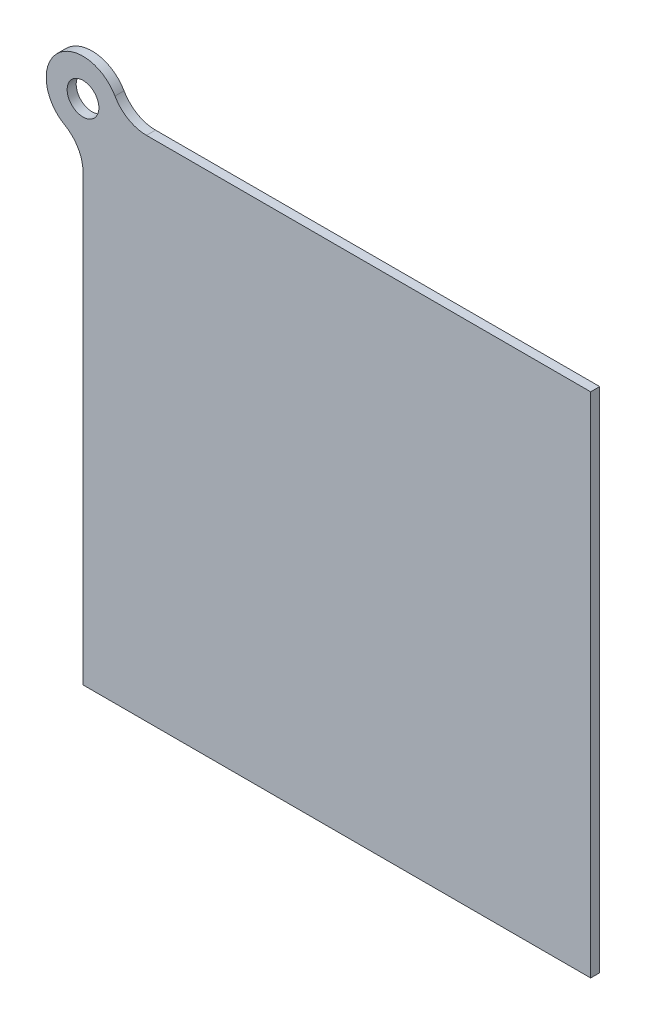
ISO-10303-21;
HEADER;
FILE_DESCRIPTION(('STEP AP214'),'2;1');
FILE_NAME('part.step','',(''),(''),'','','');
FILE_SCHEMA(('AUTOMOTIVE_DESIGN { 1 0 10303 214 1 1 1 1 }'));
ENDSEC;
DATA;
#1=APPLICATION_CONTEXT('core data for automotive mechanical design processes');
#2=APPLICATION_PROTOCOL_DEFINITION('international standard','automotive_design',2000,#1);
#3=PRODUCT_CONTEXT('',#1,'mechanical');
#4=PRODUCT('Part','Part','',(#3));
#5=PRODUCT_RELATED_PRODUCT_CATEGORY('part','',(#4));
#6=PRODUCT_DEFINITION_FORMATION('','',#4);
#7=PRODUCT_DEFINITION_CONTEXT('part definition',#1,'design');
#8=PRODUCT_DEFINITION('design','',#6,#7);
#9=PRODUCT_DEFINITION_SHAPE('','',#8);
#10=(LENGTH_UNIT() NAMED_UNIT(*) SI_UNIT(.MILLI.,.METRE.));
#11=(NAMED_UNIT(*) PLANE_ANGLE_UNIT() SI_UNIT($,.RADIAN.));
#12=(NAMED_UNIT(*) SI_UNIT($,.STERADIAN.) SOLID_ANGLE_UNIT());
#13=UNCERTAINTY_MEASURE_WITH_UNIT(LENGTH_MEASURE(1.E-05),#10,'distance_accuracy_value','');
#14=(GEOMETRIC_REPRESENTATION_CONTEXT(3) GLOBAL_UNCERTAINTY_ASSIGNED_CONTEXT((#13)) GLOBAL_UNIT_ASSIGNED_CONTEXT((#10,
#11,#12)) REPRESENTATION_CONTEXT('',''));
#15=CARTESIAN_POINT('',(0.,0.,0.));
#16=DIRECTION('',(0.,0.,1.));
#17=DIRECTION('',(1.,0.,0.));
#18=AXIS2_PLACEMENT_3D('',#15,#16,#17);
#19=CARTESIAN_POINT('',(0.,0.,2.54));
#20=DIRECTION('',(0.,0.,1.));
#21=DIRECTION('',(1.,0.,0.));
#22=AXIS2_PLACEMENT_3D('',#19,#20,#21);
#23=PLANE('',#22);
#24=DIRECTION('',(1.,0.,0.));
#25=VECTOR('',#24,1.);
#26=CARTESIAN_POINT('',(0.,-142.24,2.54));
#27=LINE('',#26,#25);
#28=CARTESIAN_POINT('',(0.,-142.24,2.54));
#29=VERTEX_POINT('',#28);
#30=CARTESIAN_POINT('',(142.24,-142.24,2.54));
#31=VERTEX_POINT('',#30);
#32=EDGE_CURVE('E102',#29,#31,#27,.T.);
#33=ORIENTED_EDGE('',*,*,#32,.T.);
#34=DIRECTION('',(0.,1.,0.));
#35=VECTOR('',#34,1.);
#36=CARTESIAN_POINT('',(142.24,-142.24,2.54));
#37=LINE('',#36,#35);
#38=CARTESIAN_POINT('',(142.24,0.,2.54));
#39=VERTEX_POINT('',#38);
#40=EDGE_CURVE('E92',#31,#39,#37,.T.);
#41=ORIENTED_EDGE('',*,*,#40,.T.);
#42=DIRECTION('',(-1.,0.,0.));
#43=VECTOR('',#42,1.);
#44=CARTESIAN_POINT('',(142.24,0.,2.54));
#45=LINE('',#44,#43);
#46=CARTESIAN_POINT('',(17.7733947730871,0.,2.54));
#47=VERTEX_POINT('',#46);
#48=EDGE_CURVE('E101',#39,#47,#45,.T.);
#49=ORIENTED_EDGE('',*,*,#48,.T.);
#50=CARTESIAN_POINT('',(17.7733947730871,10.16,2.54));
#51=DIRECTION('',(0.,0.,1.));
#52=DIRECTION('',(1.,0.,0.));
#53=AXIS2_PLACEMENT_3D('',#50,#51,#52);
#54=CIRCLE('',#53,10.16);
#55=CARTESIAN_POINT('',(8.95285146138135,5.11781637717121,2.54));
#56=VERTEX_POINT('',#55);
#57=EDGE_CURVE('E11',#47,#56,#54,.F.);
#58=ORIENTED_EDGE('',*,*,#57,.T.);
#59=CARTESIAN_POINT('',(0.,0.,2.54));
#60=DIRECTION('',(0.,0.,1.));
#61=DIRECTION('',(1.,0.,0.));
#62=AXIS2_PLACEMENT_3D('',#59,#60,#61);
#63=CIRCLE('',#62,10.3124);
#64=CARTESIAN_POINT('',(-5.11781637717122,-8.95285146138135,2.54));
#65=VERTEX_POINT('',#64);
#66=EDGE_CURVE('E136',#56,#65,#63,.T.);
#67=ORIENTED_EDGE('',*,*,#66,.T.);
#68=CARTESIAN_POINT('',(-10.16,-17.7733947730871,2.54));
#69=DIRECTION('',(0.,0.,1.));
#70=DIRECTION('',(1.,0.,0.));
#71=AXIS2_PLACEMENT_3D('',#68,#69,#70);
#72=CIRCLE('',#71,10.16);
#73=CARTESIAN_POINT('',(0.,-17.7733947730871,2.54));
#74=VERTEX_POINT('',#73);
#75=EDGE_CURVE('E132',#65,#74,#72,.F.);
#76=ORIENTED_EDGE('',*,*,#75,.T.);
#77=DIRECTION('',(0.,-1.,0.));
#78=VECTOR('',#77,1.);
#79=CARTESIAN_POINT('',(0.,-10.3124,2.54));
#80=LINE('',#79,#78);
#81=EDGE_CURVE('E107',#74,#29,#80,.T.);
#82=ORIENTED_EDGE('',*,*,#81,.T.);
#83=EDGE_LOOP('',(#33,#41,#49,#58,#67,#76,#82));
#84=FACE_BOUND('',#83,.T.);
#85=CARTESIAN_POINT('',(0.,0.,2.54));
#86=DIRECTION('',(0.,0.,1.));
#87=DIRECTION('',(1.,0.,0.));
#88=AXIS2_PLACEMENT_3D('',#85,#86,#87);
#89=CIRCLE('',#88,4.445);
#90=CARTESIAN_POINT('',(4.445,0.,2.54));
#91=VERTEX_POINT('',#90);
#92=EDGE_CURVE('E158',#91,#91,#89,.T.);
#93=ORIENTED_EDGE('',*,*,#92,.F.);
#94=EDGE_LOOP('',(#93));
#95=FACE_BOUND('',#94,.T.);
#96=ADVANCED_FACE('F33',(#84,#95),#23,.T.);
#97=CARTESIAN_POINT('',(0.,0.,0.));
#98=DIRECTION('',(0.,0.,1.));
#99=DIRECTION('',(1.,0.,0.));
#100=AXIS2_PLACEMENT_3D('',#97,#98,#99);
#101=PLANE('',#100);
#102=DIRECTION('',(1.,0.,0.));
#103=VECTOR('',#102,1.);
#104=CARTESIAN_POINT('',(0.,-142.24,0.));
#105=LINE('',#104,#103);
#106=CARTESIAN_POINT('',(0.,-142.24,0.));
#107=VERTEX_POINT('',#106);
#108=CARTESIAN_POINT('',(142.24,-142.24,0.));
#109=VERTEX_POINT('',#108);
#110=EDGE_CURVE('E115',#107,#109,#105,.T.);
#111=ORIENTED_EDGE('',*,*,#110,.F.);
#112=DIRECTION('',(0.,-1.,0.));
#113=VECTOR('',#112,1.);
#114=CARTESIAN_POINT('',(0.,-10.3124,0.));
#115=LINE('',#114,#113);
#116=CARTESIAN_POINT('',(0.,-17.7733947730871,0.));
#117=VERTEX_POINT('',#116);
#118=EDGE_CURVE('E111',#117,#107,#115,.T.);
#119=ORIENTED_EDGE('',*,*,#118,.F.);
#120=CARTESIAN_POINT('',(-10.16,-17.7733947730871,0.));
#121=DIRECTION('',(0.,0.,1.));
#122=DIRECTION('',(1.,0.,0.));
#123=AXIS2_PLACEMENT_3D('',#120,#121,#122);
#124=CIRCLE('',#123,10.16);
#125=CARTESIAN_POINT('',(-5.11781637717122,-8.95285146138135,0.));
#126=VERTEX_POINT('',#125);
#127=EDGE_CURVE('E130',#117,#126,#124,.T.);
#128=ORIENTED_EDGE('',*,*,#127,.T.);
#129=CARTESIAN_POINT('',(0.,0.,0.));
#130=DIRECTION('',(0.,0.,1.));
#131=DIRECTION('',(1.,0.,0.));
#132=AXIS2_PLACEMENT_3D('',#129,#130,#131);
#133=CIRCLE('',#132,10.3124);
#134=CARTESIAN_POINT('',(8.95285146138135,5.11781637717121,0.));
#135=VERTEX_POINT('',#134);
#136=EDGE_CURVE('E148',#135,#126,#133,.T.);
#137=ORIENTED_EDGE('',*,*,#136,.F.);
#138=CARTESIAN_POINT('',(17.7733947730871,10.16,0.));
#139=DIRECTION('',(0.,0.,1.));
#140=DIRECTION('',(1.,0.,0.));
#141=AXIS2_PLACEMENT_3D('',#138,#139,#140);
#142=CIRCLE('',#141,10.16);
#143=CARTESIAN_POINT('',(17.7733947730871,0.,0.));
#144=VERTEX_POINT('',#143);
#145=EDGE_CURVE('E41',#135,#144,#142,.T.);
#146=ORIENTED_EDGE('',*,*,#145,.T.);
#147=DIRECTION('',(-1.,0.,0.));
#148=VECTOR('',#147,1.);
#149=CARTESIAN_POINT('',(142.24,0.,0.));
#150=LINE('',#149,#148);
#151=CARTESIAN_POINT('',(142.24,0.,0.));
#152=VERTEX_POINT('',#151);
#153=EDGE_CURVE('E152',#152,#144,#150,.T.);
#154=ORIENTED_EDGE('',*,*,#153,.F.);
#155=DIRECTION('',(0.,1.,0.));
#156=VECTOR('',#155,1.);
#157=CARTESIAN_POINT('',(142.24,-142.24,0.));
#158=LINE('',#157,#156);
#159=EDGE_CURVE('E155',#109,#152,#158,.T.);
#160=ORIENTED_EDGE('',*,*,#159,.F.);
#161=EDGE_LOOP('',(#111,#119,#128,#137,#146,#154,#160));
#162=FACE_BOUND('',#161,.T.);
#163=CARTESIAN_POINT('',(0.,0.,0.));
#164=DIRECTION('',(0.,0.,1.));
#165=DIRECTION('',(1.,0.,0.));
#166=AXIS2_PLACEMENT_3D('',#163,#164,#165);
#167=CIRCLE('',#166,4.445);
#168=CARTESIAN_POINT('',(4.445,0.,0.));
#169=VERTEX_POINT('',#168);
#170=EDGE_CURVE('E161',#169,#169,#167,.T.);
#171=ORIENTED_EDGE('',*,*,#170,.T.);
#172=EDGE_LOOP('',(#171));
#173=FACE_BOUND('',#172,.T.);
#174=ADVANCED_FACE('F146',(#162,#173),#101,.F.);
#175=CARTESIAN_POINT('',(0.,-142.24,2.54));
#176=DIRECTION('',(0.,1.,0.));
#177=DIRECTION('',(0.,0.,1.));
#178=AXIS2_PLACEMENT_3D('',#175,#176,#177);
#179=PLANE('',#178);
#180=ORIENTED_EDGE('',*,*,#110,.T.);
#181=DIRECTION('',(0.,0.,-1.));
#182=VECTOR('',#181,1.);
#183=CARTESIAN_POINT('',(142.24,-142.24,2.54));
#184=LINE('',#183,#182);
#185=EDGE_CURVE('E96',#31,#109,#184,.T.);
#186=ORIENTED_EDGE('',*,*,#185,.F.);
#187=ORIENTED_EDGE('',*,*,#32,.F.);
#188=DIRECTION('',(0.,0.,-1.));
#189=VECTOR('',#188,1.);
#190=CARTESIAN_POINT('',(0.,-142.24,2.54));
#191=LINE('',#190,#189);
#192=EDGE_CURVE('E121',#29,#107,#191,.T.);
#193=ORIENTED_EDGE('',*,*,#192,.T.);
#194=EDGE_LOOP('',(#180,#186,#187,#193));
#195=FACE_BOUND('',#194,.T.);
#196=ADVANCED_FACE('F113',(#195),#179,.F.);
#197=CARTESIAN_POINT('',(142.24,-142.24,2.54));
#198=DIRECTION('',(-1.,0.,0.));
#199=DIRECTION('',(0.,0.,1.));
#200=AXIS2_PLACEMENT_3D('',#197,#198,#199);
#201=PLANE('',#200);
#202=ORIENTED_EDGE('',*,*,#159,.T.);
#203=DIRECTION('',(0.,0.,-1.));
#204=VECTOR('',#203,1.);
#205=CARTESIAN_POINT('',(142.24,0.,2.54));
#206=LINE('',#205,#204);
#207=EDGE_CURVE('E99',#39,#152,#206,.T.);
#208=ORIENTED_EDGE('',*,*,#207,.F.);
#209=ORIENTED_EDGE('',*,*,#40,.F.);
#210=ORIENTED_EDGE('',*,*,#185,.T.);
#211=EDGE_LOOP('',(#202,#208,#209,#210));
#212=FACE_BOUND('',#211,.T.);
#213=ADVANCED_FACE('F94',(#212),#201,.F.);
#214=CARTESIAN_POINT('',(142.24,0.,2.54));
#215=DIRECTION('',(0.,-1.,0.));
#216=DIRECTION('',(1.,0.,0.));
#217=AXIS2_PLACEMENT_3D('',#214,#215,#216);
#218=PLANE('',#217);
#219=ORIENTED_EDGE('',*,*,#153,.T.);
#220=DIRECTION('',(0.,0.,1.));
#221=VECTOR('',#220,1.);
#222=CARTESIAN_POINT('',(17.7733947730871,0.,2.54));
#223=LINE('',#222,#221);
#224=EDGE_CURVE('E48',#144,#47,#223,.T.);
#225=ORIENTED_EDGE('',*,*,#224,.T.);
#226=ORIENTED_EDGE('',*,*,#48,.F.);
#227=ORIENTED_EDGE('',*,*,#207,.T.);
#228=EDGE_LOOP('',(#219,#225,#226,#227));
#229=FACE_BOUND('',#228,.T.);
#230=ADVANCED_FACE('F187',(#229),#218,.F.);
#231=CARTESIAN_POINT('',(0.,0.,2.54));
#232=DIRECTION('',(0.,0.,-1.));
#233=DIRECTION('',(-1.,0.,0.));
#234=AXIS2_PLACEMENT_3D('',#231,#232,#233);
#235=CYLINDRICAL_SURFACE('',#234,10.3124);
#236=ORIENTED_EDGE('',*,*,#136,.T.);
#237=DIRECTION('',(0.,0.,-1.));
#238=VECTOR('',#237,1.);
#239=CARTESIAN_POINT('',(-5.11781637717122,-8.95285146138135,2.54));
#240=LINE('',#239,#238);
#241=EDGE_CURVE('E127',#126,#65,#240,.F.);
#242=ORIENTED_EDGE('',*,*,#241,.T.);
#243=ORIENTED_EDGE('',*,*,#66,.F.);
#244=DIRECTION('',(0.,0.,-1.));
#245=VECTOR('',#244,1.);
#246=CARTESIAN_POINT('',(8.95285146138135,5.11781637717121,2.54));
#247=LINE('',#246,#245);
#248=EDGE_CURVE('E119',#56,#135,#247,.T.);
#249=ORIENTED_EDGE('',*,*,#248,.T.);
#250=EDGE_LOOP('',(#236,#242,#243,#249));
#251=FACE_BOUND('',#250,.T.);
#252=ADVANCED_FACE('F150',(#251),#235,.T.);
#253=CARTESIAN_POINT('',(0.,-10.3124,2.54));
#254=DIRECTION('',(1.,0.,0.));
#255=DIRECTION('',(0.,1.,0.));
#256=AXIS2_PLACEMENT_3D('',#253,#254,#255);
#257=PLANE('',#256);
#258=ORIENTED_EDGE('',*,*,#81,.F.);
#259=DIRECTION('',(0.,0.,1.));
#260=VECTOR('',#259,1.);
#261=CARTESIAN_POINT('',(0.,-17.7733947730871,0.));
#262=LINE('',#261,#260);
#263=EDGE_CURVE('E116',#74,#117,#262,.F.);
#264=ORIENTED_EDGE('',*,*,#263,.T.);
#265=ORIENTED_EDGE('',*,*,#118,.T.);
#266=ORIENTED_EDGE('',*,*,#192,.F.);
#267=EDGE_LOOP('',(#258,#264,#265,#266));
#268=FACE_BOUND('',#267,.T.);
#269=ADVANCED_FACE('F141',(#268),#257,.F.);
#270=CARTESIAN_POINT('',(0.,0.,2.54));
#271=DIRECTION('',(0.,0.,-1.));
#272=DIRECTION('',(-1.,0.,0.));
#273=AXIS2_PLACEMENT_3D('',#270,#271,#272);
#274=CYLINDRICAL_SURFACE('',#273,4.445);
#275=ORIENTED_EDGE('',*,*,#92,.T.);
#276=EDGE_LOOP('',(#275));
#277=FACE_BOUND('',#276,.T.);
#278=ORIENTED_EDGE('',*,*,#170,.F.);
#279=EDGE_LOOP('',(#278));
#280=FACE_BOUND('',#279,.T.);
#281=ADVANCED_FACE('F169',(#277,#280),#274,.F.);
#282=CARTESIAN_POINT('',(-10.16,-17.7733947730871,2.54));
#283=DIRECTION('',(0.,0.,-1.));
#284=DIRECTION('',(-1.,0.,0.));
#285=AXIS2_PLACEMENT_3D('',#282,#283,#284);
#286=CYLINDRICAL_SURFACE('',#285,10.16);
#287=ORIENTED_EDGE('',*,*,#75,.F.);
#288=ORIENTED_EDGE('',*,*,#241,.F.);
#289=ORIENTED_EDGE('',*,*,#127,.F.);
#290=ORIENTED_EDGE('',*,*,#263,.F.);
#291=EDGE_LOOP('',(#287,#288,#289,#290));
#292=FACE_BOUND('',#291,.T.);
#293=ADVANCED_FACE('F144',(#292),#286,.F.);
#294=CARTESIAN_POINT('',(17.7733947730871,10.16,2.54));
#295=DIRECTION('',(0.,0.,-1.));
#296=DIRECTION('',(-1.,0.,0.));
#297=AXIS2_PLACEMENT_3D('',#294,#295,#296);
#298=CYLINDRICAL_SURFACE('',#297,10.16);
#299=ORIENTED_EDGE('',*,*,#57,.F.);
#300=ORIENTED_EDGE('',*,*,#224,.F.);
#301=ORIENTED_EDGE('',*,*,#145,.F.);
#302=ORIENTED_EDGE('',*,*,#248,.F.);
#303=EDGE_LOOP('',(#299,#300,#301,#302));
#304=FACE_BOUND('',#303,.T.);
#305=ADVANCED_FACE('F35',(#304),#298,.F.);
#306=CLOSED_SHELL('',(#96,#174,#196,#213,#230,#252,#269,#281,#293,#305));
#307=MANIFOLD_SOLID_BREP('B2',#306);
#308=ADVANCED_BREP_SHAPE_REPRESENTATION('',(#18,#307),#14);
#309=SHAPE_DEFINITION_REPRESENTATION(#9,#308);
ENDSEC;
END-ISO-10303-21;
